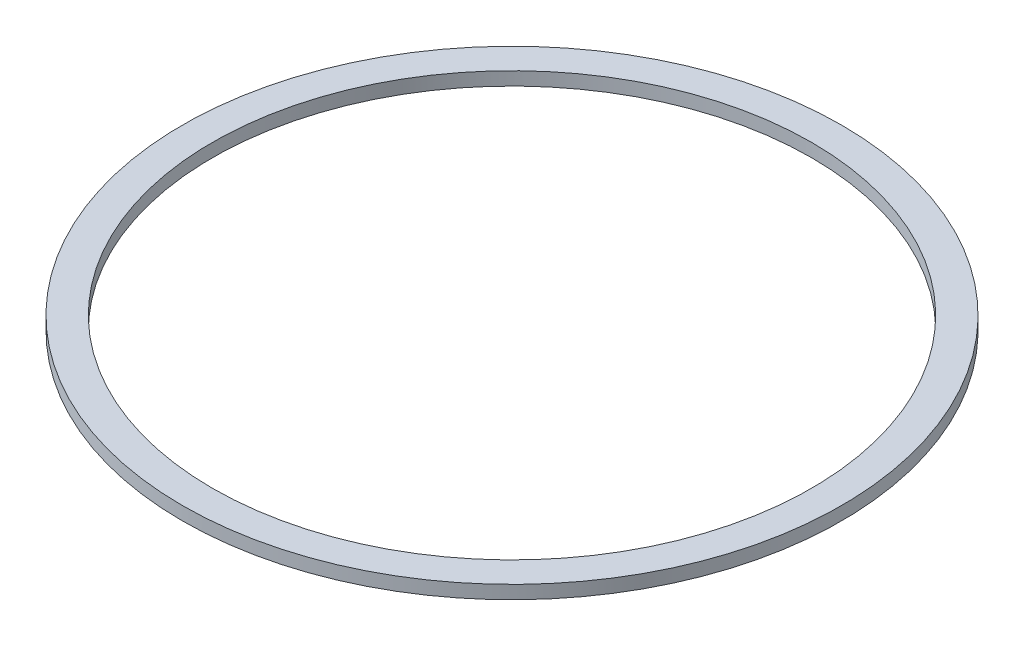
ISO-10303-21;
HEADER;
FILE_DESCRIPTION(('STEP AP214'),'2;1');
FILE_NAME('part.step','',(''),(''),'','','');
FILE_SCHEMA(('AUTOMOTIVE_DESIGN { 1 0 10303 214 1 1 1 1 }'));
ENDSEC;
DATA;
#1=APPLICATION_CONTEXT('core data for automotive mechanical design processes');
#2=APPLICATION_PROTOCOL_DEFINITION('international standard','automotive_design',2000,#1);
#3=PRODUCT_CONTEXT('',#1,'mechanical');
#4=PRODUCT('Part','Part','',(#3));
#5=PRODUCT_RELATED_PRODUCT_CATEGORY('part','',(#4));
#6=PRODUCT_DEFINITION_FORMATION('','',#4);
#7=PRODUCT_DEFINITION_CONTEXT('part definition',#1,'design');
#8=PRODUCT_DEFINITION('design','',#6,#7);
#9=PRODUCT_DEFINITION_SHAPE('','',#8);
#10=(LENGTH_UNIT() NAMED_UNIT(*) SI_UNIT(.MILLI.,.METRE.));
#11=(NAMED_UNIT(*) PLANE_ANGLE_UNIT() SI_UNIT($,.RADIAN.));
#12=(NAMED_UNIT(*) SI_UNIT($,.STERADIAN.) SOLID_ANGLE_UNIT());
#13=UNCERTAINTY_MEASURE_WITH_UNIT(LENGTH_MEASURE(1.E-05),#10,'distance_accuracy_value','');
#14=(GEOMETRIC_REPRESENTATION_CONTEXT(3) GLOBAL_UNCERTAINTY_ASSIGNED_CONTEXT((#13)) GLOBAL_UNIT_ASSIGNED_CONTEXT((#10,
#11,#12)) REPRESENTATION_CONTEXT('',''));
#15=CARTESIAN_POINT('',(0.,0.,0.));
#16=DIRECTION('',(0.,0.,1.));
#17=DIRECTION('',(1.,0.,0.));
#18=AXIS2_PLACEMENT_3D('',#15,#16,#17);
#19=CARTESIAN_POINT('',(0.,4.,0.));
#20=DIRECTION('',(0.,1.,0.));
#21=DIRECTION('',(0.,0.,1.));
#22=AXIS2_PLACEMENT_3D('',#19,#20,#21);
#23=PLANE('',#22);
#24=CARTESIAN_POINT('',(0.,4.,0.));
#25=DIRECTION('',(0.,1.,0.));
#26=DIRECTION('',(0.,0.,1.));
#27=AXIS2_PLACEMENT_3D('',#24,#25,#26);
#28=CIRCLE('',#27,99.);
#29=CARTESIAN_POINT('',(0.,4.,99.));
#30=VERTEX_POINT('',#29);
#31=EDGE_CURVE('E10',#30,#30,#28,.T.);
#32=ORIENTED_EDGE('',*,*,#31,.T.);
#33=EDGE_LOOP('',(#32));
#34=FACE_BOUND('',#33,.T.);
#35=CARTESIAN_POINT('',(0.,4.,0.));
#36=DIRECTION('',(0.,1.,0.));
#37=DIRECTION('',(0.,0.,1.));
#38=AXIS2_PLACEMENT_3D('',#35,#36,#37);
#39=CIRCLE('',#38,90.);
#40=CARTESIAN_POINT('',(0.,4.,90.));
#41=VERTEX_POINT('',#40);
#42=EDGE_CURVE('E42',#41,#41,#39,.T.);
#43=ORIENTED_EDGE('',*,*,#42,.F.);
#44=EDGE_LOOP('',(#43));
#45=FACE_BOUND('',#44,.T.);
#46=ADVANCED_FACE('F31',(#34,#45),#23,.T.);
#47=CARTESIAN_POINT('',(0.,0.,0.));
#48=DIRECTION('',(0.,1.,0.));
#49=DIRECTION('',(0.,0.,1.));
#50=AXIS2_PLACEMENT_3D('',#47,#48,#49);
#51=PLANE('',#50);
#52=CARTESIAN_POINT('',(0.,0.,0.));
#53=DIRECTION('',(0.,1.,0.));
#54=DIRECTION('',(0.,0.,1.));
#55=AXIS2_PLACEMENT_3D('',#52,#53,#54);
#56=CIRCLE('',#55,99.);
#57=CARTESIAN_POINT('',(0.,0.,99.));
#58=VERTEX_POINT('',#57);
#59=EDGE_CURVE('E35',#58,#58,#56,.T.);
#60=ORIENTED_EDGE('',*,*,#59,.F.);
#61=EDGE_LOOP('',(#60));
#62=FACE_BOUND('',#61,.T.);
#63=CARTESIAN_POINT('',(0.,0.,0.));
#64=DIRECTION('',(0.,1.,0.));
#65=DIRECTION('',(0.,0.,1.));
#66=AXIS2_PLACEMENT_3D('',#63,#64,#65);
#67=CIRCLE('',#66,90.);
#68=CARTESIAN_POINT('',(0.,0.,90.));
#69=VERTEX_POINT('',#68);
#70=EDGE_CURVE('E44',#69,#69,#67,.T.);
#71=ORIENTED_EDGE('',*,*,#70,.T.);
#72=EDGE_LOOP('',(#71));
#73=FACE_BOUND('',#72,.T.);
#74=ADVANCED_FACE('F54',(#62,#73),#51,.F.);
#75=CARTESIAN_POINT('',(0.,4.,0.));
#76=DIRECTION('',(0.,-1.,0.));
#77=DIRECTION('',(0.,0.,-1.));
#78=AXIS2_PLACEMENT_3D('',#75,#76,#77);
#79=CYLINDRICAL_SURFACE('',#78,99.);
#80=ORIENTED_EDGE('',*,*,#31,.F.);
#81=EDGE_LOOP('',(#80));
#82=FACE_BOUND('',#81,.T.);
#83=ORIENTED_EDGE('',*,*,#59,.T.);
#84=EDGE_LOOP('',(#83));
#85=FACE_BOUND('',#84,.T.);
#86=ADVANCED_FACE('F33',(#82,#85),#79,.T.);
#87=CARTESIAN_POINT('',(0.,4.,0.));
#88=DIRECTION('',(0.,-1.,0.));
#89=DIRECTION('',(0.,0.,-1.));
#90=AXIS2_PLACEMENT_3D('',#87,#88,#89);
#91=CYLINDRICAL_SURFACE('',#90,90.);
#92=ORIENTED_EDGE('',*,*,#42,.T.);
#93=EDGE_LOOP('',(#92));
#94=FACE_BOUND('',#93,.T.);
#95=ORIENTED_EDGE('',*,*,#70,.F.);
#96=EDGE_LOOP('',(#95));
#97=FACE_BOUND('',#96,.T.);
#98=ADVANCED_FACE('F50',(#94,#97),#91,.F.);
#99=CLOSED_SHELL('',(#46,#74,#86,#98));
#100=MANIFOLD_SOLID_BREP('B2',#99);
#101=ADVANCED_BREP_SHAPE_REPRESENTATION('',(#18,#100),#14);
#102=SHAPE_DEFINITION_REPRESENTATION(#9,#101);
ENDSEC;
END-ISO-10303-21;
